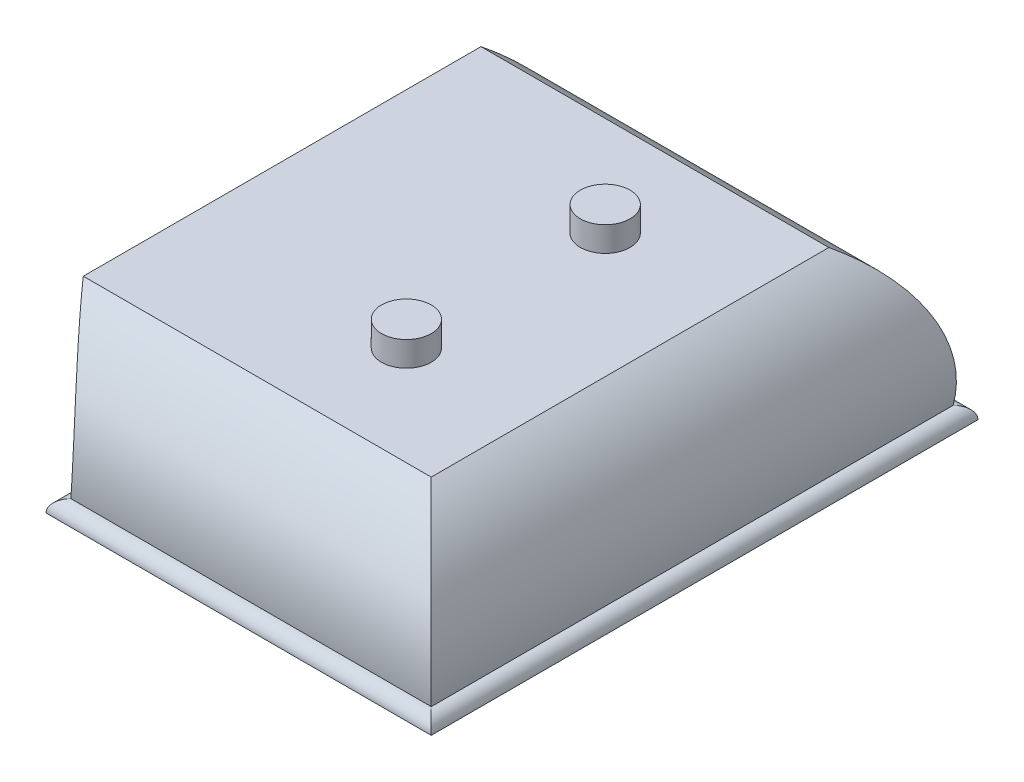
ISO-10303-21;
HEADER;
FILE_DESCRIPTION(('STEP AP214'),'2;1');
FILE_NAME('part.step','',(''),(''),'','','');
FILE_SCHEMA(('AUTOMOTIVE_DESIGN { 1 0 10303 214 1 1 1 1 }'));
ENDSEC;
DATA;
#1=APPLICATION_CONTEXT('core data for automotive mechanical design processes');
#2=APPLICATION_PROTOCOL_DEFINITION('international standard','automotive_design',2000,#1);
#3=PRODUCT_CONTEXT('',#1,'mechanical');
#4=PRODUCT('Part','Part','',(#3));
#5=PRODUCT_RELATED_PRODUCT_CATEGORY('part','',(#4));
#6=PRODUCT_DEFINITION_FORMATION('','',#4);
#7=PRODUCT_DEFINITION_CONTEXT('part definition',#1,'design');
#8=PRODUCT_DEFINITION('design','',#6,#7);
#9=PRODUCT_DEFINITION_SHAPE('','',#8);
#10=(LENGTH_UNIT() NAMED_UNIT(*) SI_UNIT(.MILLI.,.METRE.));
#11=(NAMED_UNIT(*) PLANE_ANGLE_UNIT() SI_UNIT($,.RADIAN.));
#12=(NAMED_UNIT(*) SI_UNIT($,.STERADIAN.) SOLID_ANGLE_UNIT());
#13=UNCERTAINTY_MEASURE_WITH_UNIT(LENGTH_MEASURE(1.E-05),#10,'distance_accuracy_value','');
#14=(GEOMETRIC_REPRESENTATION_CONTEXT(3) GLOBAL_UNCERTAINTY_ASSIGNED_CONTEXT((#13)) GLOBAL_UNIT_ASSIGNED_CONTEXT((#10,
#11,#12)) REPRESENTATION_CONTEXT('',''));
#15=CARTESIAN_POINT('',(0.,0.,0.));
#16=DIRECTION('',(0.,0.,1.));
#17=DIRECTION('',(1.,0.,0.));
#18=AXIS2_PLACEMENT_3D('',#15,#16,#17);
#19=CARTESIAN_POINT('',(0.,-38.1,0.));
#20=DIRECTION('',(0.,1.,0.));
#21=DIRECTION('',(0.,0.,1.));
#22=AXIS2_PLACEMENT_3D('',#19,#20,#21);
#23=PLANE('',#22);
#24=DIRECTION('',(-1.,0.,0.));
#25=VECTOR('',#24,1.);
#26=CARTESIAN_POINT('',(-133.35,-38.1,69.85));
#27=LINE('',#26,#25);
#28=CARTESIAN_POINT('',(133.35,-38.1,69.85));
#29=VERTEX_POINT('',#28);
#30=CARTESIAN_POINT('',(34.925,-38.1,69.85));
#31=VERTEX_POINT('',#30);
#32=EDGE_CURVE('E159',#29,#31,#27,.T.);
#33=ORIENTED_EDGE('',*,*,#32,.T.);
#34=DIRECTION('',(0.,0.,1.));
#35=VECTOR('',#34,1.);
#36=CARTESIAN_POINT('',(34.925,-38.1,-69.85));
#37=LINE('',#36,#35);
#38=CARTESIAN_POINT('',(34.925,-38.1,-69.85));
#39=VERTEX_POINT('',#38);
#40=EDGE_CURVE('E149',#39,#31,#37,.T.);
#41=ORIENTED_EDGE('',*,*,#40,.F.);
#42=DIRECTION('',(1.,0.,0.));
#43=VECTOR('',#42,1.);
#44=CARTESIAN_POINT('',(-133.35,-38.1,-69.85));
#45=LINE('',#44,#43);
#46=CARTESIAN_POINT('',(133.35,-38.1,-69.85));
#47=VERTEX_POINT('',#46);
#48=EDGE_CURVE('E157',#39,#47,#45,.T.);
#49=ORIENTED_EDGE('',*,*,#48,.T.);
#50=DIRECTION('',(0.,0.,1.));
#51=VECTOR('',#50,1.);
#52=CARTESIAN_POINT('',(133.35,-38.1,-69.85));
#53=LINE('',#52,#51);
#54=EDGE_CURVE('E107',#47,#29,#53,.T.);
#55=ORIENTED_EDGE('',*,*,#54,.T.);
#56=EDGE_LOOP('',(#33,#41,#49,#55));
#57=FACE_BOUND('',#56,.T.);
#58=ADVANCED_FACE('F32',(#57),#23,.F.);
#59=CARTESIAN_POINT('',(3.95857133806956,-27.5684740588838,-69.85));
#60=DIRECTION('',(0.,0.,1.));
#61=DIRECTION('',(1.,0.,0.));
#62=AXIS2_PLACEMENT_3D('',#59,#60,#61);
#63=CYLINDRICAL_SURFACE('',#62,34.925);
#64=DIRECTION('',(0.,0.,1.));
#65=VECTOR('',#64,1.);
#66=CARTESIAN_POINT('',(38.1,-34.925,-69.85));
#67=LINE('',#66,#65);
#68=CARTESIAN_POINT('',(38.1,-34.925,-66.675));
#69=VERTEX_POINT('',#68);
#70=CARTESIAN_POINT('',(38.1,-34.925,66.675));
#71=VERTEX_POINT('',#70);
#72=EDGE_CURVE('E118',#69,#71,#67,.T.);
#73=ORIENTED_EDGE('',*,*,#72,.T.);
#74=CARTESIAN_POINT('',(38.1,-34.925,66.675));
#75=CARTESIAN_POINT('',(38.1756157846421,-34.5741063832802,66.7297693303318));
#76=CARTESIAN_POINT('',(38.2459749374573,-34.2212633406051,66.779344790759));
#77=CARTESIAN_POINT('',(38.3759612906674,-33.5122653832562,66.8678653875738));
#78=CARTESIAN_POINT('',(38.4355879578964,-33.1561103049717,66.9068099958942));
#79=CARTESIAN_POINT('',(38.5438873528769,-32.4410821265741,66.9738234493696));
#80=CARTESIAN_POINT('',(38.5925592191595,-32.0822088149955,67.0018914393292));
#81=CARTESIAN_POINT('',(38.6787767678668,-31.3624688478059,67.0469621028841));
#82=CARTESIAN_POINT('',(38.7163226540331,-31.0016022288203,67.0639649791133));
#83=CARTESIAN_POINT('',(38.8118101282923,-29.9199427790342,67.0980492501062));
#84=CARTESIAN_POINT('',(38.8530700995937,-29.1969992010721,67.0984974000922));
#85=CARTESIAN_POINT('',(38.8905776275952,-27.7514930950315,67.0543854871282));
#86=CARTESIAN_POINT('',(38.886829595516,-27.0289305365511,67.0098298353789));
#87=CARTESIAN_POINT('',(38.8348679168829,-25.58876678877,66.8760437432936));
#88=CARTESIAN_POINT('',(38.7866061250289,-24.8711718191541,66.7867649790024));
#89=CARTESIAN_POINT('',(38.6469152662109,-23.4470087890365,66.5647087028999));
#90=CARTESIAN_POINT('',(38.5554839289012,-22.740441310505,66.4319289034219));
#91=CARTESIAN_POINT('',(38.331522991165,-21.3429858207258,66.1247534026532));
#92=CARTESIAN_POINT('',(38.1989873957022,-20.6521001124416,65.9503516316737));
#93=CARTESIAN_POINT('',(37.89544658379,-19.2901301553464,65.5623628879279));
#94=CARTESIAN_POINT('',(37.7244411109522,-18.61904603854,65.3487756540059));
#95=CARTESIAN_POINT('',(37.3452796737523,-17.2941201756519,64.8831249193303));
#96=CARTESIAN_POINT('',(37.1368106694157,-16.6404815854064,64.6307400201574));
#97=CARTESIAN_POINT('',(36.6869977351033,-15.359182496271,64.0918584001152));
#98=CARTESIAN_POINT('',(36.4456541966528,-14.73152168811,63.8053620855074));
#99=CARTESIAN_POINT('',(35.9331800887472,-13.5035154343886,63.2009958671742));
#100=CARTESIAN_POINT('',(35.662027696153,-12.9031904623159,62.8831029954807));
#101=CARTESIAN_POINT('',(35.0932202690531,-11.7313803102672,62.2188807222879));
#102=CARTESIAN_POINT('',(34.7955595380323,-11.1599013707066,61.8725452098515));
#103=CARTESIAN_POINT('',(34.2485731975184,-10.175636409328,61.2374123000184));
#104=CARTESIAN_POINT('',(34.0040294989617,-9.7567625327236,60.9538777702559));
#105=CARTESIAN_POINT('',(33.502517072424,-8.93673015878592,60.3727750225305));
#106=CARTESIAN_POINT('',(33.245550355969,-8.53556881344517,60.0752090767152));
#107=CARTESIAN_POINT('',(32.4575606252782,-7.35819623370949,59.1625800915153));
#108=CARTESIAN_POINT('',(31.9096094088676,-6.60838388104127,58.5277726853485));
#109=CARTESIAN_POINT('',(30.7778479383322,-5.17841853681192,57.2122492421061));
#110=CARTESIAN_POINT('',(30.1940059509022,-4.49832865058342,56.5314925246758));
#111=CARTESIAN_POINT('',(28.9996664537307,-3.20719528993444,55.1299058915077));
#112=CARTESIAN_POINT('',(28.3891803368773,-2.59612269744124,54.4090930682075));
#113=CARTESIAN_POINT('',(27.3797400176335,-1.65538021190547,53.2050332177669));
#114=CARTESIAN_POINT('',(26.9863151727284,-1.30540415483103,52.7328377802273));
#115=CARTESIAN_POINT('',(26.1957470325095,-0.632769892383667,51.7760118457363));
#116=CARTESIAN_POINT('',(25.7986219102652,-0.310019064175471,51.2914314790809));
#117=CARTESIAN_POINT('',(25.4,0.,50.8));
#118=B_SPLINE_CURVE_WITH_KNOTS('',3,(#74,#75,#76,#77,#78,#79,#80,#81,#82,#83,#84,#85,#86,#87,
#88,#89,#90,#91,#92,#93,#94,#95,#96,#97,#98,#99,#100,#101,#102,#103,#104,#105,#106,#107,#108,
#109,#110,#111,#112,#113,#114,#115,#116,#117),.UNSPECIFIED.,.F.,.F.,(4,2,2,2,2,2,2,2,2,2,2,2,2,
2,2,2,2,2,2,2,2,4),(0.,1.08923553245219,2.17852516076042,3.26790041924336,4.3572557275961,
6.52657857767079,8.69568881481803,10.8671478780767,13.0387211540717,15.2106113020525,
17.3825159253628,19.5734924915707,21.7644429662143,23.9570082597618,26.1500458673453,
27.8349254564898,29.5195331389486,32.8898810207832,36.2632529391271,39.6351962890039,
41.7564311234657,43.8701308730323),.UNSPECIFIED.);
#119=CARTESIAN_POINT('',(25.4,0.,50.8));
#120=VERTEX_POINT('',#119);
#121=EDGE_CURVE('E120',#71,#120,#118,.T.);
#122=ORIENTED_EDGE('',*,*,#121,.T.);
#123=DIRECTION('',(0.,0.,1.));
#124=VECTOR('',#123,1.);
#125=CARTESIAN_POINT('',(25.4,0.,-69.85));
#126=LINE('',#125,#124);
#127=CARTESIAN_POINT('',(25.4,0.,-50.8));
#128=VERTEX_POINT('',#127);
#129=EDGE_CURVE('E155',#128,#120,#126,.T.);
#130=ORIENTED_EDGE('',*,*,#129,.F.);
#131=CARTESIAN_POINT('',(25.4,0.,-50.8));
#132=CARTESIAN_POINT('',(25.7397167231719,-0.264206910292489,-51.2188360347855));
#133=CARTESIAN_POINT('',(26.0783758565849,-0.537685485005801,-51.632703178365));
#134=CARTESIAN_POINT('',(26.7522726954802,-1.1034731726365,-52.4503282725831));
#135=CARTESIAN_POINT('',(27.0875099846152,-1.39578454609791,-52.8540850015379));
#136=CARTESIAN_POINT('',(27.7537774401742,-2.00000838184692,-53.6519389952046));
#137=CARTESIAN_POINT('',(28.0847988855909,-2.31195539129465,-54.0460174374459));
#138=CARTESIAN_POINT('',(28.7406874391385,-2.95519804515374,-54.8232751320868));
#139=CARTESIAN_POINT('',(29.0655547482049,-3.28649305639648,-55.2064547405443));
#140=CARTESIAN_POINT('',(30.0366818796916,-4.31795510859298,-56.3478621189117));
#141=CARTESIAN_POINT('',(30.6715965755866,-5.04863644512268,-57.0885809408351));
#142=CARTESIAN_POINT('',(31.8996778003076,-6.5917786059894,-58.5163778614032));
#143=CARTESIAN_POINT('',(32.4928765003657,-7.40417521009996,-59.20349734136));
#144=CARTESIAN_POINT('',(33.4719213638726,-8.87958979446597,-60.33737358768));
#145=CARTESIAN_POINT('',(33.8702886474441,-9.52315582787871,-60.7986829308742));
#146=CARTESIAN_POINT('',(34.6338399956274,-10.8540507568141,-61.6844986351194));
#147=CARTESIAN_POINT('',(34.9990237089892,-11.5413801154431,-62.1090046066023));
#148=CARTESIAN_POINT('',(35.6892620012941,-12.955624894166,-62.9147957397906));
#149=CARTESIAN_POINT('',(36.0144821361376,-13.6823576894037,-63.2962586374825));
#150=CARTESIAN_POINT('',(36.6209192363841,-15.1759015068086,-64.0129954190929));
#151=CARTESIAN_POINT('',(36.9021441264903,-15.9427052778644,-64.3482776200682));
#152=CARTESIAN_POINT('',(37.373773439519,-17.3870664477537,-64.9178407269196));
#153=CARTESIAN_POINT('',(37.5715099023388,-18.0592487288596,-65.1596976270076));
#154=CARTESIAN_POINT('',(37.9285876611579,-19.4264470614554,-65.6041222215526));
#155=CARTESIAN_POINT('',(38.087932468935,-20.1214610178628,-65.8066935092288));
#156=CARTESIAN_POINT('',(38.3652033535933,-21.5306755168412,-66.1697681284248));
#157=CARTESIAN_POINT('',(38.4831224319798,-22.2448792794346,-66.3302643505892));
#158=CARTESIAN_POINT('',(38.6749233630554,-23.6877309871576,-66.606770857829));
#159=CARTESIAN_POINT('',(38.7488038695262,-24.4163793731424,-66.7227797829301));
#160=CARTESIAN_POINT('',(38.8559913423862,-25.9603593852978,-66.9184056352404));
#161=CARTESIAN_POINT('',(38.8841811399403,-26.77670887575,-66.9928764411598));
#162=CARTESIAN_POINT('',(38.8829416861842,-28.4128978868097,-67.0841274323255));
#163=CARTESIAN_POINT('',(38.8535000244832,-29.2327381211812,-67.1008951896205));
#164=CARTESIAN_POINT('',(38.7660114301929,-30.4612757964826,-67.0829658923493));
#165=CARTESIAN_POINT('',(38.72942086488,-30.8720320014136,-67.0696853237714));
#166=CARTESIAN_POINT('',(38.6418133271017,-31.6913332674618,-67.0287657690499));
#167=CARTESIAN_POINT('',(38.5907959405823,-32.0998782647736,-67.0011263707845));
#168=CARTESIAN_POINT('',(38.4745559591793,-32.9136918091155,-66.9317360608869));
#169=CARTESIAN_POINT('',(38.4093343314131,-33.3189605772651,-66.8899861098864));
#170=CARTESIAN_POINT('',(38.2650037480323,-34.1253260115432,-66.7927257720626));
#171=CARTESIAN_POINT('',(38.1858957453417,-34.5264229619548,-66.7372163293484));
#172=CARTESIAN_POINT('',(38.1,-34.925,-66.675));
#173=B_SPLINE_CURVE_WITH_KNOTS('',3,(#131,#132,#133,#134,#135,#136,#137,#138,#139,#140,#141,
#142,#143,#144,#145,#146,#147,#148,#149,#150,#151,#152,#153,#154,#155,#156,#157,#158,#159,#160,
#161,#162,#163,#164,#165,#166,#167,#168,#169,#170,#171,#172),.UNSPECIFIED.,.F.,.F.,(4,2,2,2,2,2,
2,2,2,2,2,2,2,2,2,2,2,2,2,2,4),(0.,1.80151742508034,3.60325149475918,5.40824931017989,
7.21318808961996,10.8653497666759,14.5146633002802,17.1716307625176,19.8286263456341,
22.4742145986942,25.119325761528,27.3408067433169,29.5620844436392,31.7837372280776,
34.0054579229089,36.4621377039034,38.9193465658959,40.1567160641996,41.3941210789838,
42.6314418694934,43.8686777845768),.UNSPECIFIED.);
#174=EDGE_CURVE('E128',#128,#69,#173,.T.);
#175=ORIENTED_EDGE('',*,*,#174,.T.);
#176=EDGE_LOOP('',(#73,#122,#130,#175));
#177=FACE_BOUND('',#176,.T.);
#178=ADVANCED_FACE('F130',(#177),#63,.F.);
#179=CARTESIAN_POINT('',(38.1,-38.1,-69.85));
#180=DIRECTION('',(0.,0.,1.));
#181=DIRECTION('',(1.,0.,0.));
#182=AXIS2_PLACEMENT_3D('',#179,#180,#181);
#183=CYLINDRICAL_SURFACE('',#182,3.175);
#184=ORIENTED_EDGE('',*,*,#40,.T.);
#185=CARTESIAN_POINT('',(38.1,-38.1,66.675));
#186=DIRECTION('',(0.707106781186547,0.,0.707106781186547));
#187=DIRECTION('',(-0.707106781186547,0.,0.707106781186547));
#188=AXIS2_PLACEMENT_3D('',#185,#186,#187);
#189=ELLIPSE('',#188,4.49012806053458,3.175);
#190=EDGE_CURVE('E151',#31,#71,#189,.F.);
#191=ORIENTED_EDGE('',*,*,#190,.T.);
#192=ORIENTED_EDGE('',*,*,#72,.F.);
#193=CARTESIAN_POINT('',(38.1,-38.1,-66.675));
#194=DIRECTION('',(-0.707106781186547,0.,0.707106781186547));
#195=DIRECTION('',(0.707106781186547,0.,0.707106781186547));
#196=AXIS2_PLACEMENT_3D('',#193,#194,#195);
#197=ELLIPSE('',#196,4.49012806053458,3.175);
#198=EDGE_CURVE('E87',#69,#39,#197,.T.);
#199=ORIENTED_EDGE('',*,*,#198,.T.);
#200=EDGE_LOOP('',(#184,#191,#192,#199));
#201=FACE_BOUND('',#200,.T.);
#202=ADVANCED_FACE('F178',(#201),#183,.T.);
#203=CARTESIAN_POINT('',(95.6676965721384,-29.5396833763007,-69.85));
#204=DIRECTION('',(0.,0.,1.));
#205=DIRECTION('',(1.,0.,0.));
#206=AXIS2_PLACEMENT_3D('',#203,#204,#205);
#207=CYLINDRICAL_SURFACE('',#206,34.925);
#208=DIRECTION('',(0.,0.,-1.));
#209=VECTOR('',#208,1.);
#210=CARTESIAN_POINT('',(114.3,0.,50.8));
#211=LINE('',#210,#209);
#212=CARTESIAN_POINT('',(114.3,0.,50.8));
#213=VERTEX_POINT('',#212);
#214=CARTESIAN_POINT('',(114.3,0.,-50.8));
#215=VERTEX_POINT('',#214);
#216=EDGE_CURVE('E48',#213,#215,#211,.T.);
#217=ORIENTED_EDGE('',*,*,#216,.F.);
#218=CARTESIAN_POINT('',(95.6676965721384,-29.5396833763007,32.1676965721384));
#219=DIRECTION('',(-0.707106781186547,0.,0.707106781186547));
#220=DIRECTION('',(0.707106781186547,0.,0.707106781186547));
#221=AXIS2_PLACEMENT_3D('',#218,#219,#220);
#222=ELLIPSE('',#221,49.3914086658803,34.925);
#223=CARTESIAN_POINT('',(130.175,-34.925,66.675));
#224=VERTEX_POINT('',#223);
#225=EDGE_CURVE('E100',#213,#224,#222,.F.);
#226=ORIENTED_EDGE('',*,*,#225,.T.);
#227=DIRECTION('',(0.,0.,1.));
#228=VECTOR('',#227,1.);
#229=CARTESIAN_POINT('',(130.175,-34.925,-69.85));
#230=LINE('',#229,#228);
#231=CARTESIAN_POINT('',(130.175,-34.925,-66.675));
#232=VERTEX_POINT('',#231);
#233=EDGE_CURVE('E99',#232,#224,#230,.T.);
#234=ORIENTED_EDGE('',*,*,#233,.F.);
#235=CARTESIAN_POINT('',(95.6676965721384,-29.5396833763007,-32.1676965721384));
#236=DIRECTION('',(0.707106781186547,0.,0.707106781186547));
#237=DIRECTION('',(-0.707106781186547,0.,0.707106781186547));
#238=AXIS2_PLACEMENT_3D('',#235,#236,#237);
#239=ELLIPSE('',#238,49.3914086658803,34.925);
#240=EDGE_CURVE('E94',#232,#215,#239,.T.);
#241=ORIENTED_EDGE('',*,*,#240,.T.);
#242=EDGE_LOOP('',(#217,#226,#234,#241));
#243=FACE_BOUND('',#242,.T.);
#244=ADVANCED_FACE('F112',(#243),#207,.T.);
#245=CARTESIAN_POINT('',(130.175,-38.1,-69.85));
#246=DIRECTION('',(0.,0.,1.));
#247=DIRECTION('',(1.,0.,0.));
#248=AXIS2_PLACEMENT_3D('',#245,#246,#247);
#249=CYLINDRICAL_SURFACE('',#248,3.17500000000001);
#250=ORIENTED_EDGE('',*,*,#233,.T.);
#251=CARTESIAN_POINT('',(130.175,-38.1,66.675));
#252=DIRECTION('',(-0.707106781186547,0.,0.707106781186547));
#253=DIRECTION('',(0.707106781186547,0.,0.707106781186547));
#254=AXIS2_PLACEMENT_3D('',#251,#252,#253);
#255=ELLIPSE('',#254,4.4901280605346,3.17500000000001);
#256=EDGE_CURVE('E109',#224,#29,#255,.F.);
#257=ORIENTED_EDGE('',*,*,#256,.T.);
#258=ORIENTED_EDGE('',*,*,#54,.F.);
#259=CARTESIAN_POINT('',(130.175,-38.1,-66.675));
#260=DIRECTION('',(0.707106781186547,0.,0.707106781186547));
#261=DIRECTION('',(-0.707106781186547,0.,0.707106781186547));
#262=AXIS2_PLACEMENT_3D('',#259,#260,#261);
#263=ELLIPSE('',#262,4.4901280605346,3.17500000000001);
#264=EDGE_CURVE('E84',#47,#232,#263,.T.);
#265=ORIENTED_EDGE('',*,*,#264,.T.);
#266=EDGE_LOOP('',(#250,#257,#258,#265));
#267=FACE_BOUND('',#266,.T.);
#268=ADVANCED_FACE('F104',(#267),#249,.T.);
#269=CARTESIAN_POINT('',(-133.35,-29.5396833763007,-32.1676965721384));
#270=DIRECTION('',(1.,0.,0.));
#271=DIRECTION('',(0.,0.,-1.));
#272=AXIS2_PLACEMENT_3D('',#269,#270,#271);
#273=CYLINDRICAL_SURFACE('',#272,34.925);
#274=DIRECTION('',(-1.,0.,0.));
#275=VECTOR('',#274,1.);
#276=CARTESIAN_POINT('',(-114.3,0.,-50.8));
#277=LINE('',#276,#275);
#278=EDGE_CURVE('E96',#215,#128,#277,.T.);
#279=ORIENTED_EDGE('',*,*,#278,.F.);
#280=ORIENTED_EDGE('',*,*,#240,.F.);
#281=DIRECTION('',(1.,0.,0.));
#282=VECTOR('',#281,1.);
#283=CARTESIAN_POINT('',(-133.35,-34.925,-66.675));
#284=LINE('',#283,#282);
#285=EDGE_CURVE('E80',#69,#232,#284,.T.);
#286=ORIENTED_EDGE('',*,*,#285,.F.);
#287=ORIENTED_EDGE('',*,*,#174,.F.);
#288=EDGE_LOOP('',(#279,#280,#286,#287));
#289=FACE_BOUND('',#288,.T.);
#290=ADVANCED_FACE('F95',(#289),#273,.T.);
#291=CARTESIAN_POINT('',(-133.35,-38.1,-66.675));
#292=DIRECTION('',(1.,0.,0.));
#293=DIRECTION('',(0.,0.,-1.));
#294=AXIS2_PLACEMENT_3D('',#291,#292,#293);
#295=CYLINDRICAL_SURFACE('',#294,3.17500000000001);
#296=ORIENTED_EDGE('',*,*,#285,.T.);
#297=ORIENTED_EDGE('',*,*,#264,.F.);
#298=ORIENTED_EDGE('',*,*,#48,.F.);
#299=ORIENTED_EDGE('',*,*,#198,.F.);
#300=EDGE_LOOP('',(#296,#297,#298,#299));
#301=FACE_BOUND('',#300,.T.);
#302=ADVANCED_FACE('F82',(#301),#295,.T.);
#303=CARTESIAN_POINT('',(-133.35,-29.5396833763007,32.1676965721384));
#304=DIRECTION('',(1.,0.,0.));
#305=DIRECTION('',(0.,0.,-1.));
#306=AXIS2_PLACEMENT_3D('',#303,#304,#305);
#307=CYLINDRICAL_SURFACE('',#306,34.925);
#308=DIRECTION('',(1.,0.,0.));
#309=VECTOR('',#308,1.);
#310=CARTESIAN_POINT('',(-133.35,-34.925,66.675));
#311=LINE('',#310,#309);
#312=EDGE_CURVE('E91',#71,#224,#311,.T.);
#313=ORIENTED_EDGE('',*,*,#312,.T.);
#314=ORIENTED_EDGE('',*,*,#225,.F.);
#315=DIRECTION('',(1.,0.,0.));
#316=VECTOR('',#315,1.);
#317=CARTESIAN_POINT('',(-114.3,0.,50.8));
#318=LINE('',#317,#316);
#319=EDGE_CURVE('E153',#120,#213,#318,.T.);
#320=ORIENTED_EDGE('',*,*,#319,.F.);
#321=ORIENTED_EDGE('',*,*,#121,.F.);
#322=EDGE_LOOP('',(#313,#314,#320,#321));
#323=FACE_BOUND('',#322,.T.);
#324=ADVANCED_FACE('F134',(#323),#307,.T.);
#325=CARTESIAN_POINT('',(-133.35,-38.1,66.675));
#326=DIRECTION('',(1.,0.,0.));
#327=DIRECTION('',(0.,0.,-1.));
#328=AXIS2_PLACEMENT_3D('',#325,#326,#327);
#329=CYLINDRICAL_SURFACE('',#328,3.17500000000001);
#330=ORIENTED_EDGE('',*,*,#32,.F.);
#331=ORIENTED_EDGE('',*,*,#256,.F.);
#332=ORIENTED_EDGE('',*,*,#312,.F.);
#333=ORIENTED_EDGE('',*,*,#190,.F.);
#334=EDGE_LOOP('',(#330,#331,#332,#333));
#335=FACE_BOUND('',#334,.T.);
#336=ADVANCED_FACE('F138',(#335),#329,.T.);
#337=CARTESIAN_POINT('',(-117.475,0.,-69.85));
#338=DIRECTION('',(0.,-1.,0.));
#339=DIRECTION('',(0.,0.,-1.));
#340=AXIS2_PLACEMENT_3D('',#337,#338,#339);
#341=PLANE('',#340);
#342=CARTESIAN_POINT('',(82.55,0.,-25.4));
#343=DIRECTION('',(0.,-1.,0.));
#344=DIRECTION('',(0.,0.,-1.));
#345=AXIS2_PLACEMENT_3D('',#342,#343,#344);
#346=CIRCLE('',#345,6.35);
#347=CARTESIAN_POINT('',(82.55,0.,-31.75));
#348=VERTEX_POINT('',#347);
#349=EDGE_CURVE('E11',#348,#348,#346,.F.);
#350=ORIENTED_EDGE('',*,*,#349,.F.);
#351=EDGE_LOOP('',(#350));
#352=FACE_BOUND('',#351,.T.);
#353=CARTESIAN_POINT('',(82.55,0.,25.4));
#354=DIRECTION('',(0.,-1.,0.));
#355=DIRECTION('',(0.,0.,-1.));
#356=AXIS2_PLACEMENT_3D('',#353,#354,#355);
#357=CIRCLE('',#356,6.35);
#358=CARTESIAN_POINT('',(82.55,0.,19.05));
#359=VERTEX_POINT('',#358);
#360=EDGE_CURVE('E41',#359,#359,#357,.F.);
#361=ORIENTED_EDGE('',*,*,#360,.F.);
#362=EDGE_LOOP('',(#361));
#363=FACE_BOUND('',#362,.T.);
#364=ORIENTED_EDGE('',*,*,#278,.T.);
#365=ORIENTED_EDGE('',*,*,#129,.T.);
#366=ORIENTED_EDGE('',*,*,#319,.T.);
#367=ORIENTED_EDGE('',*,*,#216,.T.);
#368=EDGE_LOOP('',(#364,#365,#366,#367));
#369=FACE_BOUND('',#368,.T.);
#370=ADVANCED_FACE('F34',(#352,#363,#369),#341,.F.);
#371=CARTESIAN_POINT('',(82.55,6.35,25.4));
#372=DIRECTION('',(0.,-1.,0.));
#373=DIRECTION('',(0.,0.,-1.));
#374=AXIS2_PLACEMENT_3D('',#371,#372,#373);
#375=CYLINDRICAL_SURFACE('',#374,6.35);
#376=CARTESIAN_POINT('',(82.55,6.35,25.4));
#377=DIRECTION('',(0.,1.,0.));
#378=DIRECTION('',(0.,0.,1.));
#379=AXIS2_PLACEMENT_3D('',#376,#377,#378);
#380=CIRCLE('',#379,6.35);
#381=CARTESIAN_POINT('',(82.55,6.35,31.75));
#382=VERTEX_POINT('',#381);
#383=EDGE_CURVE('E162',#382,#382,#380,.T.);
#384=ORIENTED_EDGE('',*,*,#383,.F.);
#385=EDGE_LOOP('',(#384));
#386=FACE_BOUND('',#385,.T.);
#387=ORIENTED_EDGE('',*,*,#360,.T.);
#388=EDGE_LOOP('',(#387));
#389=FACE_BOUND('',#388,.T.);
#390=ADVANCED_FACE('F196',(#386,#389),#375,.T.);
#391=CARTESIAN_POINT('',(82.55,6.35,25.4));
#392=DIRECTION('',(0.,1.,0.));
#393=DIRECTION('',(0.,0.,1.));
#394=AXIS2_PLACEMENT_3D('',#391,#392,#393);
#395=PLANE('',#394);
#396=ORIENTED_EDGE('',*,*,#383,.T.);
#397=EDGE_LOOP('',(#396));
#398=FACE_BOUND('',#397,.T.);
#399=ADVANCED_FACE('F201',(#398),#395,.T.);
#400=CARTESIAN_POINT('',(82.55,6.35,-25.4));
#401=DIRECTION('',(0.,-1.,0.));
#402=DIRECTION('',(0.,0.,-1.));
#403=AXIS2_PLACEMENT_3D('',#400,#401,#402);
#404=CYLINDRICAL_SURFACE('',#403,6.35);
#405=CARTESIAN_POINT('',(82.55,6.35,-25.4));
#406=DIRECTION('',(0.,1.,0.));
#407=DIRECTION('',(0.,0.,1.));
#408=AXIS2_PLACEMENT_3D('',#405,#406,#407);
#409=CIRCLE('',#408,6.35);
#410=CARTESIAN_POINT('',(82.55,6.35,-19.05));
#411=VERTEX_POINT('',#410);
#412=EDGE_CURVE('E221',#411,#411,#409,.T.);
#413=ORIENTED_EDGE('',*,*,#412,.F.);
#414=EDGE_LOOP('',(#413));
#415=FACE_BOUND('',#414,.T.);
#416=ORIENTED_EDGE('',*,*,#349,.T.);
#417=EDGE_LOOP('',(#416));
#418=FACE_BOUND('',#417,.T.);
#419=ADVANCED_FACE('F206',(#415,#418),#404,.T.);
#420=CARTESIAN_POINT('',(82.55,6.35,-25.4));
#421=DIRECTION('',(0.,1.,0.));
#422=DIRECTION('',(0.,0.,1.));
#423=AXIS2_PLACEMENT_3D('',#420,#421,#422);
#424=PLANE('',#423);
#425=ORIENTED_EDGE('',*,*,#412,.T.);
#426=EDGE_LOOP('',(#425));
#427=FACE_BOUND('',#426,.T.);
#428=ADVANCED_FACE('F208',(#427),#424,.T.);
#429=CLOSED_SHELL('',(#58,#178,#202,#244,#268,#290,#302,#324,#336,#370,#390,#399,#419,#428));
#430=MANIFOLD_SOLID_BREP('B2',#429);
#431=ADVANCED_BREP_SHAPE_REPRESENTATION('',(#18,#430),#14);
#432=SHAPE_DEFINITION_REPRESENTATION(#9,#431);
ENDSEC;
END-ISO-10303-21;
